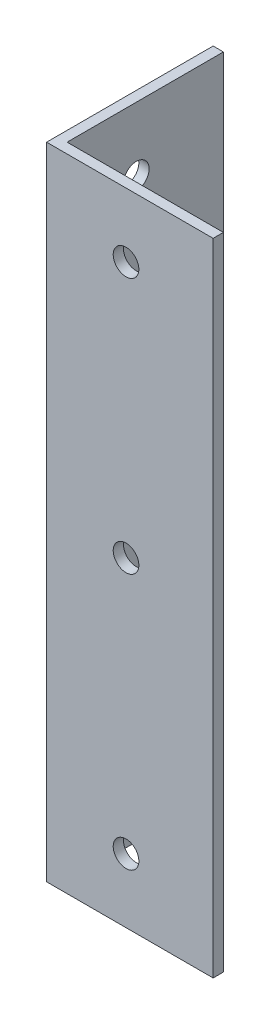
ISO-10303-21;
HEADER;
FILE_DESCRIPTION(('STEP AP214'),'2;1');
FILE_NAME('part.step','',(''),(''),'','','');
FILE_SCHEMA(('AUTOMOTIVE_DESIGN { 1 0 10303 214 1 1 1 1 }'));
ENDSEC;
DATA;
#1=APPLICATION_CONTEXT('core data for automotive mechanical design processes');
#2=APPLICATION_PROTOCOL_DEFINITION('international standard','automotive_design',2000,#1);
#3=PRODUCT_CONTEXT('',#1,'mechanical');
#4=PRODUCT('Part','Part','',(#3));
#5=PRODUCT_RELATED_PRODUCT_CATEGORY('part','',(#4));
#6=PRODUCT_DEFINITION_FORMATION('','',#4);
#7=PRODUCT_DEFINITION_CONTEXT('part definition',#1,'design');
#8=PRODUCT_DEFINITION('design','',#6,#7);
#9=PRODUCT_DEFINITION_SHAPE('','',#8);
#10=(LENGTH_UNIT() NAMED_UNIT(*) SI_UNIT(.MILLI.,.METRE.));
#11=(NAMED_UNIT(*) PLANE_ANGLE_UNIT() SI_UNIT($,.RADIAN.));
#12=(NAMED_UNIT(*) SI_UNIT($,.STERADIAN.) SOLID_ANGLE_UNIT());
#13=UNCERTAINTY_MEASURE_WITH_UNIT(LENGTH_MEASURE(1.E-05),#10,'distance_accuracy_value','');
#14=(GEOMETRIC_REPRESENTATION_CONTEXT(3) GLOBAL_UNCERTAINTY_ASSIGNED_CONTEXT((#13)) GLOBAL_UNIT_ASSIGNED_CONTEXT((#10,
#11,#12)) REPRESENTATION_CONTEXT('',''));
#15=CARTESIAN_POINT('',(0.,0.,0.));
#16=DIRECTION('',(0.,0.,1.));
#17=DIRECTION('',(1.,0.,0.));
#18=AXIS2_PLACEMENT_3D('',#15,#16,#17);
#19=CARTESIAN_POINT('',(4.,250.,0.));
#20=DIRECTION('',(-1.,0.,0.));
#21=DIRECTION('',(0.,0.,1.));
#22=AXIS2_PLACEMENT_3D('',#19,#20,#21);
#23=PLANE('',#22);
#24=CARTESIAN_POINT('',(4.,125.,-31.0000000000004));
#25=DIRECTION('',(-1.,0.,0.));
#26=DIRECTION('',(0.,0.,1.));
#27=AXIS2_PLACEMENT_3D('',#24,#25,#26);
#28=CIRCLE('',#27,5.00000000000001);
#29=CARTESIAN_POINT('',(4.,125.,-26.0000000000003));
#30=VERTEX_POINT('',#29);
#31=EDGE_CURVE('E163',#30,#30,#28,.T.);
#32=ORIENTED_EDGE('',*,*,#31,.T.);
#33=EDGE_LOOP('',(#32));
#34=FACE_BOUND('',#33,.T.);
#35=CARTESIAN_POINT('',(4.,225.,-31.0000000000007));
#36=DIRECTION('',(-1.,0.,0.));
#37=DIRECTION('',(0.,0.,1.));
#38=AXIS2_PLACEMENT_3D('',#35,#36,#37);
#39=CIRCLE('',#38,5.00000000000001);
#40=CARTESIAN_POINT('',(4.,225.,-26.0000000000007));
#41=VERTEX_POINT('',#40);
#42=EDGE_CURVE('E158',#41,#41,#39,.T.);
#43=ORIENTED_EDGE('',*,*,#42,.T.);
#44=EDGE_LOOP('',(#43));
#45=FACE_BOUND('',#44,.T.);
#46=CARTESIAN_POINT('',(4.,25.,-31.));
#47=DIRECTION('',(-1.,0.,0.));
#48=DIRECTION('',(0.,0.,1.));
#49=AXIS2_PLACEMENT_3D('',#46,#47,#48);
#50=CIRCLE('',#49,5.);
#51=CARTESIAN_POINT('',(4.,25.,-26.));
#52=VERTEX_POINT('',#51);
#53=EDGE_CURVE('E121',#52,#52,#50,.T.);
#54=ORIENTED_EDGE('',*,*,#53,.T.);
#55=EDGE_LOOP('',(#54));
#56=FACE_BOUND('',#55,.T.);
#57=DIRECTION('',(0.,0.,-1.));
#58=VECTOR('',#57,1.);
#59=CARTESIAN_POINT('',(4.,0.,0.));
#60=LINE('',#59,#58);
#61=CARTESIAN_POINT('',(4.,0.,-4.));
#62=VERTEX_POINT('',#61);
#63=CARTESIAN_POINT('',(4.,0.,-65.));
#64=VERTEX_POINT('',#63);
#65=EDGE_CURVE('E117',#62,#64,#60,.T.);
#66=ORIENTED_EDGE('',*,*,#65,.T.);
#67=DIRECTION('',(0.,-1.,0.));
#68=VECTOR('',#67,1.);
#69=CARTESIAN_POINT('',(4.,250.,-65.));
#70=LINE('',#69,#68);
#71=CARTESIAN_POINT('',(4.,250.,-65.));
#72=VERTEX_POINT('',#71);
#73=EDGE_CURVE('E11',#72,#64,#70,.T.);
#74=ORIENTED_EDGE('',*,*,#73,.F.);
#75=DIRECTION('',(0.,0.,-1.));
#76=VECTOR('',#75,1.);
#77=CARTESIAN_POINT('',(4.,250.,0.));
#78=LINE('',#77,#76);
#79=CARTESIAN_POINT('',(4.,250.,-4.));
#80=VERTEX_POINT('',#79);
#81=EDGE_CURVE('E82',#80,#72,#78,.T.);
#82=ORIENTED_EDGE('',*,*,#81,.F.);
#83=DIRECTION('',(0.,-1.,0.));
#84=VECTOR('',#83,1.);
#85=CARTESIAN_POINT('',(4.,250.,-4.));
#86=LINE('',#85,#84);
#87=EDGE_CURVE('E113',#80,#62,#86,.T.);
#88=ORIENTED_EDGE('',*,*,#87,.T.);
#89=EDGE_LOOP('',(#66,#74,#82,#88));
#90=FACE_BOUND('',#89,.T.);
#91=ADVANCED_FACE('F34',(#34,#45,#56,#90),#23,.F.);
#92=CARTESIAN_POINT('',(0.,250.,-65.));
#93=DIRECTION('',(0.,0.,-1.));
#94=DIRECTION('',(-1.,0.,0.));
#95=AXIS2_PLACEMENT_3D('',#92,#93,#94);
#96=PLANE('',#95);
#97=DIRECTION('',(1.,0.,0.));
#98=VECTOR('',#97,1.);
#99=CARTESIAN_POINT('',(0.,0.,-65.));
#100=LINE('',#99,#98);
#101=CARTESIAN_POINT('',(0.,0.,-65.));
#102=VERTEX_POINT('',#101);
#103=EDGE_CURVE('E120',#102,#64,#100,.T.);
#104=ORIENTED_EDGE('',*,*,#103,.F.);
#105=DIRECTION('',(0.,-1.,0.));
#106=VECTOR('',#105,1.);
#107=CARTESIAN_POINT('',(0.,250.,-65.));
#108=LINE('',#107,#106);
#109=CARTESIAN_POINT('',(0.,250.,-65.));
#110=VERTEX_POINT('',#109);
#111=EDGE_CURVE('E43',#110,#102,#108,.T.);
#112=ORIENTED_EDGE('',*,*,#111,.F.);
#113=DIRECTION('',(1.,0.,0.));
#114=VECTOR('',#113,1.);
#115=CARTESIAN_POINT('',(0.,250.,-65.));
#116=LINE('',#115,#114);
#117=EDGE_CURVE('E172',#110,#72,#116,.T.);
#118=ORIENTED_EDGE('',*,*,#117,.T.);
#119=ORIENTED_EDGE('',*,*,#73,.T.);
#120=EDGE_LOOP('',(#104,#112,#118,#119));
#121=FACE_BOUND('',#120,.T.);
#122=ADVANCED_FACE('F194',(#121),#96,.T.);
#123=CARTESIAN_POINT('',(0.,250.,0.));
#124=DIRECTION('',(-1.,0.,0.));
#125=DIRECTION('',(0.,0.,1.));
#126=AXIS2_PLACEMENT_3D('',#123,#124,#125);
#127=PLANE('',#126);
#128=CARTESIAN_POINT('',(0.,125.,-31.0000000000004));
#129=DIRECTION('',(-1.,0.,0.));
#130=DIRECTION('',(0.,0.,1.));
#131=AXIS2_PLACEMENT_3D('',#128,#129,#130);
#132=CIRCLE('',#131,5.00000000000001);
#133=CARTESIAN_POINT('',(0.,125.,-26.0000000000003));
#134=VERTEX_POINT('',#133);
#135=EDGE_CURVE('E155',#134,#134,#132,.T.);
#136=ORIENTED_EDGE('',*,*,#135,.F.);
#137=EDGE_LOOP('',(#136));
#138=FACE_BOUND('',#137,.T.);
#139=CARTESIAN_POINT('',(0.,225.,-31.0000000000007));
#140=DIRECTION('',(-1.,0.,0.));
#141=DIRECTION('',(0.,0.,1.));
#142=AXIS2_PLACEMENT_3D('',#139,#140,#141);
#143=CIRCLE('',#142,5.00000000000001);
#144=CARTESIAN_POINT('',(0.,225.,-26.0000000000007));
#145=VERTEX_POINT('',#144);
#146=EDGE_CURVE('E137',#145,#145,#143,.T.);
#147=ORIENTED_EDGE('',*,*,#146,.F.);
#148=EDGE_LOOP('',(#147));
#149=FACE_BOUND('',#148,.T.);
#150=CARTESIAN_POINT('',(0.,25.,-31.));
#151=DIRECTION('',(-1.,0.,0.));
#152=DIRECTION('',(0.,0.,1.));
#153=AXIS2_PLACEMENT_3D('',#150,#151,#152);
#154=CIRCLE('',#153,5.);
#155=CARTESIAN_POINT('',(0.,25.,-26.));
#156=VERTEX_POINT('',#155);
#157=EDGE_CURVE('E166',#156,#156,#154,.T.);
#158=ORIENTED_EDGE('',*,*,#157,.F.);
#159=EDGE_LOOP('',(#158));
#160=FACE_BOUND('',#159,.T.);
#161=DIRECTION('',(0.,0.,-1.));
#162=VECTOR('',#161,1.);
#163=CARTESIAN_POINT('',(0.,0.,0.));
#164=LINE('',#163,#162);
#165=CARTESIAN_POINT('',(0.,0.,0.));
#166=VERTEX_POINT('',#165);
#167=EDGE_CURVE('E124',#166,#102,#164,.T.);
#168=ORIENTED_EDGE('',*,*,#167,.F.);
#169=DIRECTION('',(0.,-1.,0.));
#170=VECTOR('',#169,1.);
#171=CARTESIAN_POINT('',(0.,250.,0.));
#172=LINE('',#171,#170);
#173=CARTESIAN_POINT('',(0.,250.,0.));
#174=VERTEX_POINT('',#173);
#175=EDGE_CURVE('E103',#174,#166,#172,.T.);
#176=ORIENTED_EDGE('',*,*,#175,.F.);
#177=DIRECTION('',(0.,0.,-1.));
#178=VECTOR('',#177,1.);
#179=CARTESIAN_POINT('',(0.,250.,0.));
#180=LINE('',#179,#178);
#181=EDGE_CURVE('E109',#174,#110,#180,.T.);
#182=ORIENTED_EDGE('',*,*,#181,.T.);
#183=ORIENTED_EDGE('',*,*,#111,.T.);
#184=EDGE_LOOP('',(#168,#176,#182,#183));
#185=FACE_BOUND('',#184,.T.);
#186=ADVANCED_FACE('F176',(#138,#149,#160,#185),#127,.T.);
#187=CARTESIAN_POINT('',(0.,250.,0.));
#188=DIRECTION('',(0.,0.,1.));
#189=DIRECTION('',(1.,0.,0.));
#190=AXIS2_PLACEMENT_3D('',#187,#188,#189);
#191=PLANE('',#190);
#192=CARTESIAN_POINT('',(30.9999999999996,125.,0.));
#193=DIRECTION('',(0.,0.,1.));
#194=DIRECTION('',(1.,0.,0.));
#195=AXIS2_PLACEMENT_3D('',#192,#193,#194);
#196=CIRCLE('',#195,4.99999999999999);
#197=CARTESIAN_POINT('',(35.9999999999996,125.,0.));
#198=VERTEX_POINT('',#197);
#199=EDGE_CURVE('E141',#198,#198,#196,.T.);
#200=ORIENTED_EDGE('',*,*,#199,.F.);
#201=EDGE_LOOP('',(#200));
#202=FACE_BOUND('',#201,.T.);
#203=CARTESIAN_POINT('',(30.9999999999993,225.,0.));
#204=DIRECTION('',(0.,0.,1.));
#205=DIRECTION('',(1.,0.,0.));
#206=AXIS2_PLACEMENT_3D('',#203,#204,#205);
#207=CIRCLE('',#206,5.);
#208=CARTESIAN_POINT('',(35.9999999999993,225.,0.));
#209=VERTEX_POINT('',#208);
#210=EDGE_CURVE('E146',#209,#209,#207,.T.);
#211=ORIENTED_EDGE('',*,*,#210,.F.);
#212=EDGE_LOOP('',(#211));
#213=FACE_BOUND('',#212,.T.);
#214=CARTESIAN_POINT('',(31.,25.,0.));
#215=DIRECTION('',(0.,0.,1.));
#216=DIRECTION('',(1.,0.,0.));
#217=AXIS2_PLACEMENT_3D('',#214,#215,#216);
#218=CIRCLE('',#217,5.);
#219=CARTESIAN_POINT('',(36.,25.,0.));
#220=VERTEX_POINT('',#219);
#221=EDGE_CURVE('E138',#220,#220,#218,.T.);
#222=ORIENTED_EDGE('',*,*,#221,.F.);
#223=EDGE_LOOP('',(#222));
#224=FACE_BOUND('',#223,.T.);
#225=DIRECTION('',(-1.,0.,0.));
#226=VECTOR('',#225,1.);
#227=CARTESIAN_POINT('',(0.,0.,0.));
#228=LINE('',#227,#226);
#229=CARTESIAN_POINT('',(65.,0.,0.));
#230=VERTEX_POINT('',#229);
#231=EDGE_CURVE('E98',#230,#166,#228,.T.);
#232=ORIENTED_EDGE('',*,*,#231,.F.);
#233=DIRECTION('',(0.,-1.,0.));
#234=VECTOR('',#233,1.);
#235=CARTESIAN_POINT('',(65.,250.,0.));
#236=LINE('',#235,#234);
#237=CARTESIAN_POINT('',(65.,250.,0.));
#238=VERTEX_POINT('',#237);
#239=EDGE_CURVE('E93',#238,#230,#236,.T.);
#240=ORIENTED_EDGE('',*,*,#239,.F.);
#241=DIRECTION('',(-1.,0.,0.));
#242=VECTOR('',#241,1.);
#243=CARTESIAN_POINT('',(0.,250.,0.));
#244=LINE('',#243,#242);
#245=EDGE_CURVE('E96',#238,#174,#244,.T.);
#246=ORIENTED_EDGE('',*,*,#245,.T.);
#247=ORIENTED_EDGE('',*,*,#175,.T.);
#248=EDGE_LOOP('',(#232,#240,#246,#247));
#249=FACE_BOUND('',#248,.T.);
#250=ADVANCED_FACE('F95',(#202,#213,#224,#249),#191,.T.);
#251=CARTESIAN_POINT('',(65.,250.,-4.));
#252=DIRECTION('',(1.,0.,0.));
#253=DIRECTION('',(0.,0.,-1.));
#254=AXIS2_PLACEMENT_3D('',#251,#252,#253);
#255=PLANE('',#254);
#256=DIRECTION('',(0.,0.,1.));
#257=VECTOR('',#256,1.);
#258=CARTESIAN_POINT('',(65.,0.,-4.));
#259=LINE('',#258,#257);
#260=CARTESIAN_POINT('',(65.,0.,-4.));
#261=VERTEX_POINT('',#260);
#262=EDGE_CURVE('E128',#261,#230,#259,.T.);
#263=ORIENTED_EDGE('',*,*,#262,.F.);
#264=DIRECTION('',(0.,-1.,0.));
#265=VECTOR('',#264,1.);
#266=CARTESIAN_POINT('',(65.,250.,-4.));
#267=LINE('',#266,#265);
#268=CARTESIAN_POINT('',(65.,250.,-4.));
#269=VERTEX_POINT('',#268);
#270=EDGE_CURVE('E73',#269,#261,#267,.T.);
#271=ORIENTED_EDGE('',*,*,#270,.F.);
#272=DIRECTION('',(0.,0.,1.));
#273=VECTOR('',#272,1.);
#274=CARTESIAN_POINT('',(65.,250.,-4.));
#275=LINE('',#274,#273);
#276=EDGE_CURVE('E107',#269,#238,#275,.T.);
#277=ORIENTED_EDGE('',*,*,#276,.T.);
#278=ORIENTED_EDGE('',*,*,#239,.T.);
#279=EDGE_LOOP('',(#263,#271,#277,#278));
#280=FACE_BOUND('',#279,.T.);
#281=ADVANCED_FACE('F111',(#280),#255,.T.);
#282=CARTESIAN_POINT('',(0.,250.,-4.));
#283=DIRECTION('',(0.,0.,1.));
#284=DIRECTION('',(1.,0.,0.));
#285=AXIS2_PLACEMENT_3D('',#282,#283,#284);
#286=PLANE('',#285);
#287=CARTESIAN_POINT('',(30.9999999999996,125.,-4.));
#288=DIRECTION('',(0.,0.,1.));
#289=DIRECTION('',(1.,0.,0.));
#290=AXIS2_PLACEMENT_3D('',#287,#288,#289);
#291=CIRCLE('',#290,4.99999999999999);
#292=CARTESIAN_POINT('',(35.9999999999996,125.,-4.));
#293=VERTEX_POINT('',#292);
#294=EDGE_CURVE('E37',#293,#293,#291,.T.);
#295=ORIENTED_EDGE('',*,*,#294,.T.);
#296=EDGE_LOOP('',(#295));
#297=FACE_BOUND('',#296,.T.);
#298=CARTESIAN_POINT('',(30.9999999999993,225.,-4.));
#299=DIRECTION('',(0.,0.,1.));
#300=DIRECTION('',(1.,0.,0.));
#301=AXIS2_PLACEMENT_3D('',#298,#299,#300);
#302=CIRCLE('',#301,5.);
#303=CARTESIAN_POINT('',(35.9999999999993,225.,-4.));
#304=VERTEX_POINT('',#303);
#305=EDGE_CURVE('E139',#304,#304,#302,.T.);
#306=ORIENTED_EDGE('',*,*,#305,.T.);
#307=EDGE_LOOP('',(#306));
#308=FACE_BOUND('',#307,.T.);
#309=CARTESIAN_POINT('',(31.,25.,-4.));
#310=DIRECTION('',(0.,0.,1.));
#311=DIRECTION('',(1.,0.,0.));
#312=AXIS2_PLACEMENT_3D('',#309,#310,#311);
#313=CIRCLE('',#312,5.);
#314=CARTESIAN_POINT('',(36.,25.,-4.));
#315=VERTEX_POINT('',#314);
#316=EDGE_CURVE('E135',#315,#315,#313,.T.);
#317=ORIENTED_EDGE('',*,*,#316,.T.);
#318=EDGE_LOOP('',(#317));
#319=FACE_BOUND('',#318,.T.);
#320=DIRECTION('',(1.,0.,0.));
#321=VECTOR('',#320,1.);
#322=CARTESIAN_POINT('',(0.,0.,-4.));
#323=LINE('',#322,#321);
#324=EDGE_CURVE('E76',#261,#62,#323,.F.);
#325=ORIENTED_EDGE('',*,*,#324,.T.);
#326=ORIENTED_EDGE('',*,*,#87,.F.);
#327=DIRECTION('',(1.,0.,0.));
#328=VECTOR('',#327,1.);
#329=CARTESIAN_POINT('',(0.,250.,-4.));
#330=LINE('',#329,#328);
#331=EDGE_CURVE('E52',#269,#80,#330,.F.);
#332=ORIENTED_EDGE('',*,*,#331,.F.);
#333=ORIENTED_EDGE('',*,*,#270,.T.);
#334=EDGE_LOOP('',(#325,#326,#332,#333));
#335=FACE_BOUND('',#334,.T.);
#336=ADVANCED_FACE('F182',(#297,#308,#319,#335),#286,.F.);
#337=CARTESIAN_POINT('',(0.,250.,0.));
#338=DIRECTION('',(0.,-1.,0.));
#339=DIRECTION('',(-1.,0.,0.));
#340=AXIS2_PLACEMENT_3D('',#337,#338,#339);
#341=PLANE('',#340);
#342=ORIENTED_EDGE('',*,*,#81,.T.);
#343=ORIENTED_EDGE('',*,*,#117,.F.);
#344=ORIENTED_EDGE('',*,*,#181,.F.);
#345=ORIENTED_EDGE('',*,*,#245,.F.);
#346=ORIENTED_EDGE('',*,*,#276,.F.);
#347=ORIENTED_EDGE('',*,*,#331,.T.);
#348=EDGE_LOOP('',(#342,#343,#344,#345,#346,#347));
#349=FACE_BOUND('',#348,.T.);
#350=ADVANCED_FACE('F106',(#349),#341,.F.);
#351=CARTESIAN_POINT('',(0.,0.,0.));
#352=DIRECTION('',(0.,-1.,0.));
#353=DIRECTION('',(-1.,0.,0.));
#354=AXIS2_PLACEMENT_3D('',#351,#352,#353);
#355=PLANE('',#354);
#356=ORIENTED_EDGE('',*,*,#65,.F.);
#357=ORIENTED_EDGE('',*,*,#324,.F.);
#358=ORIENTED_EDGE('',*,*,#262,.T.);
#359=ORIENTED_EDGE('',*,*,#231,.T.);
#360=ORIENTED_EDGE('',*,*,#167,.T.);
#361=ORIENTED_EDGE('',*,*,#103,.T.);
#362=EDGE_LOOP('',(#356,#357,#358,#359,#360,#361));
#363=FACE_BOUND('',#362,.T.);
#364=ADVANCED_FACE('F180',(#363),#355,.T.);
#365=CARTESIAN_POINT('',(10.,25.,-31.));
#366=DIRECTION('',(-1.,0.,0.));
#367=DIRECTION('',(0.,0.,1.));
#368=AXIS2_PLACEMENT_3D('',#365,#366,#367);
#369=CYLINDRICAL_SURFACE('',#368,5.);
#370=ORIENTED_EDGE('',*,*,#157,.T.);
#371=EDGE_LOOP('',(#370));
#372=FACE_BOUND('',#371,.T.);
#373=ORIENTED_EDGE('',*,*,#53,.F.);
#374=EDGE_LOOP('',(#373));
#375=FACE_BOUND('',#374,.T.);
#376=ADVANCED_FACE('F206',(#372,#375),#369,.F.);
#377=CARTESIAN_POINT('',(10.,225.,-31.0000000000007));
#378=DIRECTION('',(-1.,0.,0.));
#379=DIRECTION('',(0.,0.,1.));
#380=AXIS2_PLACEMENT_3D('',#377,#378,#379);
#381=CYLINDRICAL_SURFACE('',#380,5.00000000000001);
#382=ORIENTED_EDGE('',*,*,#146,.T.);
#383=EDGE_LOOP('',(#382));
#384=FACE_BOUND('',#383,.T.);
#385=ORIENTED_EDGE('',*,*,#42,.F.);
#386=EDGE_LOOP('',(#385));
#387=FACE_BOUND('',#386,.T.);
#388=ADVANCED_FACE('F208',(#384,#387),#381,.F.);
#389=CARTESIAN_POINT('',(10.,125.,-31.0000000000004));
#390=DIRECTION('',(-1.,0.,0.));
#391=DIRECTION('',(0.,0.,1.));
#392=AXIS2_PLACEMENT_3D('',#389,#390,#391);
#393=CYLINDRICAL_SURFACE('',#392,5.00000000000001);
#394=ORIENTED_EDGE('',*,*,#135,.T.);
#395=EDGE_LOOP('',(#394));
#396=FACE_BOUND('',#395,.T.);
#397=ORIENTED_EDGE('',*,*,#31,.F.);
#398=EDGE_LOOP('',(#397));
#399=FACE_BOUND('',#398,.T.);
#400=ADVANCED_FACE('F215',(#396,#399),#393,.F.);
#401=CARTESIAN_POINT('',(31.,25.,-10.));
#402=DIRECTION('',(0.,0.,1.));
#403=DIRECTION('',(1.,0.,0.));
#404=AXIS2_PLACEMENT_3D('',#401,#402,#403);
#405=CYLINDRICAL_SURFACE('',#404,5.);
#406=ORIENTED_EDGE('',*,*,#221,.T.);
#407=EDGE_LOOP('',(#406));
#408=FACE_BOUND('',#407,.T.);
#409=ORIENTED_EDGE('',*,*,#316,.F.);
#410=EDGE_LOOP('',(#409));
#411=FACE_BOUND('',#410,.T.);
#412=ADVANCED_FACE('F221',(#408,#411),#405,.F.);
#413=CARTESIAN_POINT('',(30.9999999999993,225.,-10.));
#414=DIRECTION('',(0.,0.,1.));
#415=DIRECTION('',(1.,0.,0.));
#416=AXIS2_PLACEMENT_3D('',#413,#414,#415);
#417=CYLINDRICAL_SURFACE('',#416,5.);
#418=ORIENTED_EDGE('',*,*,#210,.T.);
#419=EDGE_LOOP('',(#418));
#420=FACE_BOUND('',#419,.T.);
#421=ORIENTED_EDGE('',*,*,#305,.F.);
#422=EDGE_LOOP('',(#421));
#423=FACE_BOUND('',#422,.T.);
#424=ADVANCED_FACE('F225',(#420,#423),#417,.F.);
#425=CARTESIAN_POINT('',(30.9999999999996,125.,-10.));
#426=DIRECTION('',(0.,0.,1.));
#427=DIRECTION('',(1.,0.,0.));
#428=AXIS2_PLACEMENT_3D('',#425,#426,#427);
#429=CYLINDRICAL_SURFACE('',#428,4.99999999999999);
#430=ORIENTED_EDGE('',*,*,#199,.T.);
#431=EDGE_LOOP('',(#430));
#432=FACE_BOUND('',#431,.T.);
#433=ORIENTED_EDGE('',*,*,#294,.F.);
#434=EDGE_LOOP('',(#433));
#435=FACE_BOUND('',#434,.T.);
#436=ADVANCED_FACE('F229',(#432,#435),#429,.F.);
#437=CLOSED_SHELL('',(#91,#122,#186,#250,#281,#336,#350,#364,#376,#388,#400,#412,#424,#436));
#438=MANIFOLD_SOLID_BREP('B2',#437);
#439=ADVANCED_BREP_SHAPE_REPRESENTATION('',(#18,#438),#14);
#440=SHAPE_DEFINITION_REPRESENTATION(#9,#439);
ENDSEC;
END-ISO-10303-21;
